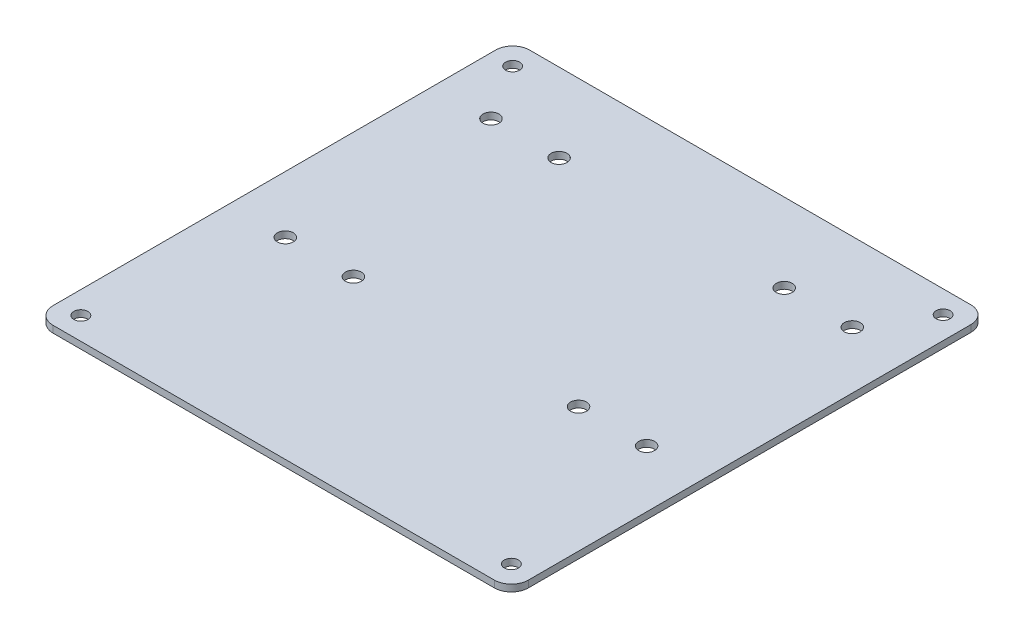
ISO-10303-21;
HEADER;
FILE_DESCRIPTION(('STEP AP214'),'2;1');
FILE_NAME('part.step','',(''),(''),'','','');
FILE_SCHEMA(('AUTOMOTIVE_DESIGN { 1 0 10303 214 1 1 1 1 }'));
ENDSEC;
DATA;
#1=APPLICATION_CONTEXT('core data for automotive mechanical design processes');
#2=APPLICATION_PROTOCOL_DEFINITION('international standard','automotive_design',2000,#1);
#3=PRODUCT_CONTEXT('',#1,'mechanical');
#4=PRODUCT('Part','Part','',(#3));
#5=PRODUCT_RELATED_PRODUCT_CATEGORY('part','',(#4));
#6=PRODUCT_DEFINITION_FORMATION('','',#4);
#7=PRODUCT_DEFINITION_CONTEXT('part definition',#1,'design');
#8=PRODUCT_DEFINITION('design','',#6,#7);
#9=PRODUCT_DEFINITION_SHAPE('','',#8);
#10=(LENGTH_UNIT() NAMED_UNIT(*) SI_UNIT(.MILLI.,.METRE.));
#11=(NAMED_UNIT(*) PLANE_ANGLE_UNIT() SI_UNIT($,.RADIAN.));
#12=(NAMED_UNIT(*) SI_UNIT($,.STERADIAN.) SOLID_ANGLE_UNIT());
#13=UNCERTAINTY_MEASURE_WITH_UNIT(LENGTH_MEASURE(1.E-05),#10,'distance_accuracy_value','');
#14=(GEOMETRIC_REPRESENTATION_CONTEXT(3) GLOBAL_UNCERTAINTY_ASSIGNED_CONTEXT((#13)) GLOBAL_UNIT_ASSIGNED_CONTEXT((#10,
#11,#12)) REPRESENTATION_CONTEXT('',''));
#15=CARTESIAN_POINT('',(0.,0.,0.));
#16=DIRECTION('',(0.,0.,1.));
#17=DIRECTION('',(1.,0.,0.));
#18=AXIS2_PLACEMENT_3D('',#15,#16,#17);
#19=CARTESIAN_POINT('',(0.,1.6,0.));
#20=DIRECTION('',(0.,1.,0.));
#21=DIRECTION('',(0.,0.,1.));
#22=AXIS2_PLACEMENT_3D('',#19,#20,#21);
#23=PLANE('',#22);
#24=CARTESIAN_POINT('',(-42.45,1.6,-37.51));
#25=DIRECTION('',(0.,1.,0.));
#26=DIRECTION('',(0.,0.,-1.));
#27=AXIS2_PLACEMENT_3D('',#24,#25,#26);
#28=CIRCLE('',#27,1.875);
#29=CARTESIAN_POINT('',(-42.45,1.6,-39.385));
#30=VERTEX_POINT('',#29);
#31=EDGE_CURVE('E235',#30,#30,#28,.T.);
#32=ORIENTED_EDGE('',*,*,#31,.F.);
#33=EDGE_LOOP('',(#32));
#34=FACE_BOUND('',#33,.T.);
#35=CARTESIAN_POINT('',(26.45,1.6,-37.51));
#36=DIRECTION('',(0.,1.,0.));
#37=DIRECTION('',(0.,0.,1.));
#38=AXIS2_PLACEMENT_3D('',#35,#36,#37);
#39=CIRCLE('',#38,1.875);
#40=CARTESIAN_POINT('',(26.45,1.6,-35.635));
#41=VERTEX_POINT('',#40);
#42=EDGE_CURVE('E223',#41,#41,#39,.T.);
#43=ORIENTED_EDGE('',*,*,#42,.F.);
#44=EDGE_LOOP('',(#43));
#45=FACE_BOUND('',#44,.T.);
#46=CARTESIAN_POINT('',(42.45,1.6,10.82));
#47=DIRECTION('',(0.,1.,0.));
#48=DIRECTION('',(0.,0.,1.));
#49=AXIS2_PLACEMENT_3D('',#46,#47,#48);
#50=CIRCLE('',#49,1.875);
#51=CARTESIAN_POINT('',(42.45,1.6,12.695));
#52=VERTEX_POINT('',#51);
#53=EDGE_CURVE('E211',#52,#52,#50,.T.);
#54=ORIENTED_EDGE('',*,*,#53,.F.);
#55=EDGE_LOOP('',(#54));
#56=FACE_BOUND('',#55,.T.);
#57=CARTESIAN_POINT('',(26.45,1.6,10.82));
#58=DIRECTION('',(0.,1.,0.));
#59=DIRECTION('',(0.,0.,1.));
#60=AXIS2_PLACEMENT_3D('',#57,#58,#59);
#61=CIRCLE('',#60,1.875);
#62=CARTESIAN_POINT('',(26.45,1.6,12.695));
#63=VERTEX_POINT('',#62);
#64=EDGE_CURVE('E199',#63,#63,#61,.T.);
#65=ORIENTED_EDGE('',*,*,#64,.F.);
#66=EDGE_LOOP('',(#65));
#67=FACE_BOUND('',#66,.T.);
#68=CARTESIAN_POINT('',(50.575,1.6,-50.725));
#69=DIRECTION('',(0.,1.,0.));
#70=DIRECTION('',(0.,0.,1.));
#71=AXIS2_PLACEMENT_3D('',#68,#69,#70);
#72=CIRCLE('',#71,1.65);
#73=CARTESIAN_POINT('',(50.575,1.6,-49.075));
#74=VERTEX_POINT('',#73);
#75=EDGE_CURVE('E187',#74,#74,#72,.T.);
#76=ORIENTED_EDGE('',*,*,#75,.F.);
#77=EDGE_LOOP('',(#76));
#78=FACE_BOUND('',#77,.T.);
#79=CARTESIAN_POINT('',(-50.575,1.6,-50.725));
#80=DIRECTION('',(0.,1.,0.));
#81=DIRECTION('',(0.,0.,1.));
#82=AXIS2_PLACEMENT_3D('',#79,#80,#81);
#83=CIRCLE('',#82,1.65);
#84=CARTESIAN_POINT('',(-50.575,1.6,-49.075));
#85=VERTEX_POINT('',#84);
#86=EDGE_CURVE('E170',#85,#85,#83,.T.);
#87=ORIENTED_EDGE('',*,*,#86,.F.);
#88=EDGE_LOOP('',(#87));
#89=FACE_BOUND('',#88,.T.);
#90=DIRECTION('',(0.,0.,1.));
#91=VECTOR('',#90,1.);
#92=CARTESIAN_POINT('',(-55.85,1.6,-56.));
#93=LINE('',#92,#91);
#94=CARTESIAN_POINT('',(-55.85,1.6,-52.));
#95=VERTEX_POINT('',#94);
#96=CARTESIAN_POINT('',(-55.85,1.6,52.));
#97=VERTEX_POINT('',#96);
#98=EDGE_CURVE('E177',#95,#97,#93,.T.);
#99=ORIENTED_EDGE('',*,*,#98,.T.);
#100=CARTESIAN_POINT('',(-51.85,1.6,52.));
#101=DIRECTION('',(0.,1.,0.));
#102=DIRECTION('',(0.,0.,1.));
#103=AXIS2_PLACEMENT_3D('',#100,#101,#102);
#104=CIRCLE('',#103,4.);
#105=CARTESIAN_POINT('',(-51.85,1.6,56.));
#106=VERTEX_POINT('',#105);
#107=EDGE_CURVE('E154',#97,#106,#104,.T.);
#108=ORIENTED_EDGE('',*,*,#107,.T.);
#109=DIRECTION('',(1.,0.,0.));
#110=VECTOR('',#109,1.);
#111=CARTESIAN_POINT('',(-55.85,1.6,56.));
#112=LINE('',#111,#110);
#113=CARTESIAN_POINT('',(51.85,1.6,56.));
#114=VERTEX_POINT('',#113);
#115=EDGE_CURVE('E125',#106,#114,#112,.T.);
#116=ORIENTED_EDGE('',*,*,#115,.T.);
#117=CARTESIAN_POINT('',(51.85,1.6,52.));
#118=DIRECTION('',(0.,1.,0.));
#119=DIRECTION('',(0.,0.,1.));
#120=AXIS2_PLACEMENT_3D('',#117,#118,#119);
#121=CIRCLE('',#120,4.);
#122=CARTESIAN_POINT('',(55.85,1.6,52.));
#123=VERTEX_POINT('',#122);
#124=EDGE_CURVE('E149',#114,#123,#121,.T.);
#125=ORIENTED_EDGE('',*,*,#124,.T.);
#126=DIRECTION('',(0.,0.,-1.));
#127=VECTOR('',#126,1.);
#128=CARTESIAN_POINT('',(55.85,1.6,-56.));
#129=LINE('',#128,#127);
#130=CARTESIAN_POINT('',(55.85,1.6,-52.));
#131=VERTEX_POINT('',#130);
#132=EDGE_CURVE('E132',#123,#131,#129,.T.);
#133=ORIENTED_EDGE('',*,*,#132,.T.);
#134=CARTESIAN_POINT('',(51.85,1.6,-52.));
#135=DIRECTION('',(0.,1.,0.));
#136=DIRECTION('',(0.,0.,1.));
#137=AXIS2_PLACEMENT_3D('',#134,#135,#136);
#138=CIRCLE('',#137,4.);
#139=CARTESIAN_POINT('',(51.85,1.6,-56.));
#140=VERTEX_POINT('',#139);
#141=EDGE_CURVE('E61',#131,#140,#138,.T.);
#142=ORIENTED_EDGE('',*,*,#141,.T.);
#143=DIRECTION('',(-1.,0.,0.));
#144=VECTOR('',#143,1.);
#145=CARTESIAN_POINT('',(-55.85,1.6,-56.));
#146=LINE('',#145,#144);
#147=CARTESIAN_POINT('',(-51.85,1.6,-56.));
#148=VERTEX_POINT('',#147);
#149=EDGE_CURVE('E135',#140,#148,#146,.T.);
#150=ORIENTED_EDGE('',*,*,#149,.T.);
#151=CARTESIAN_POINT('',(-51.85,1.6,-52.));
#152=DIRECTION('',(0.,1.,0.));
#153=DIRECTION('',(0.,0.,1.));
#154=AXIS2_PLACEMENT_3D('',#151,#152,#153);
#155=CIRCLE('',#154,4.);
#156=EDGE_CURVE('E152',#148,#95,#155,.T.);
#157=ORIENTED_EDGE('',*,*,#156,.T.);
#158=EDGE_LOOP('',(#99,#108,#116,#125,#133,#142,#150,#157));
#159=FACE_BOUND('',#158,.T.);
#160=CARTESIAN_POINT('',(-50.575,1.6,50.725));
#161=DIRECTION('',(0.,1.,0.));
#162=DIRECTION('',(0.,0.,1.));
#163=AXIS2_PLACEMENT_3D('',#160,#161,#162);
#164=CIRCLE('',#163,1.65);
#165=CARTESIAN_POINT('',(-50.575,1.6,52.375));
#166=VERTEX_POINT('',#165);
#167=EDGE_CURVE('E182',#166,#166,#164,.T.);
#168=ORIENTED_EDGE('',*,*,#167,.F.);
#169=EDGE_LOOP('',(#168));
#170=FACE_BOUND('',#169,.T.);
#171=CARTESIAN_POINT('',(50.575,1.6,50.725));
#172=DIRECTION('',(0.,1.,0.));
#173=DIRECTION('',(0.,0.,1.));
#174=AXIS2_PLACEMENT_3D('',#171,#172,#173);
#175=CIRCLE('',#174,1.65);
#176=CARTESIAN_POINT('',(50.575,1.6,52.375));
#177=VERTEX_POINT('',#176);
#178=EDGE_CURVE('E193',#177,#177,#175,.T.);
#179=ORIENTED_EDGE('',*,*,#178,.F.);
#180=EDGE_LOOP('',(#179));
#181=FACE_BOUND('',#180,.T.);
#182=CARTESIAN_POINT('',(-42.45,1.6,10.82));
#183=DIRECTION('',(0.,1.,0.));
#184=DIRECTION('',(0.,0.,-1.));
#185=AXIS2_PLACEMENT_3D('',#182,#183,#184);
#186=CIRCLE('',#185,1.875);
#187=CARTESIAN_POINT('',(-42.45,1.6,8.945));
#188=VERTEX_POINT('',#187);
#189=EDGE_CURVE('E205',#188,#188,#186,.T.);
#190=ORIENTED_EDGE('',*,*,#189,.F.);
#191=EDGE_LOOP('',(#190));
#192=FACE_BOUND('',#191,.T.);
#193=CARTESIAN_POINT('',(42.45,1.6,-37.51));
#194=DIRECTION('',(0.,1.,0.));
#195=DIRECTION('',(0.,0.,1.));
#196=AXIS2_PLACEMENT_3D('',#193,#194,#195);
#197=CIRCLE('',#196,1.875);
#198=CARTESIAN_POINT('',(42.45,1.6,-35.635));
#199=VERTEX_POINT('',#198);
#200=EDGE_CURVE('E217',#199,#199,#197,.T.);
#201=ORIENTED_EDGE('',*,*,#200,.F.);
#202=EDGE_LOOP('',(#201));
#203=FACE_BOUND('',#202,.T.);
#204=CARTESIAN_POINT('',(-26.45,1.6,10.82));
#205=DIRECTION('',(0.,1.,0.));
#206=DIRECTION('',(0.,0.,-1.));
#207=AXIS2_PLACEMENT_3D('',#204,#205,#206);
#208=CIRCLE('',#207,1.875);
#209=CARTESIAN_POINT('',(-26.45,1.6,8.945));
#210=VERTEX_POINT('',#209);
#211=EDGE_CURVE('E229',#210,#210,#208,.T.);
#212=ORIENTED_EDGE('',*,*,#211,.F.);
#213=EDGE_LOOP('',(#212));
#214=FACE_BOUND('',#213,.T.);
#215=CARTESIAN_POINT('',(-26.45,1.6,-37.51));
#216=DIRECTION('',(0.,1.,0.));
#217=DIRECTION('',(0.,0.,-1.));
#218=AXIS2_PLACEMENT_3D('',#215,#216,#217);
#219=CIRCLE('',#218,1.875);
#220=CARTESIAN_POINT('',(-26.45,1.6,-39.385));
#221=VERTEX_POINT('',#220);
#222=EDGE_CURVE('E241',#221,#221,#219,.T.);
#223=ORIENTED_EDGE('',*,*,#222,.F.);
#224=EDGE_LOOP('',(#223));
#225=FACE_BOUND('',#224,.T.);
#226=ADVANCED_FACE('F39',(#34,#45,#56,#67,#78,#89,#159,#170,#181,#192,#203,#214,#225),#23,.T.);
#227=CARTESIAN_POINT('',(0.,0.,0.));
#228=DIRECTION('',(0.,1.,0.));
#229=DIRECTION('',(0.,0.,1.));
#230=AXIS2_PLACEMENT_3D('',#227,#228,#229);
#231=PLANE('',#230);
#232=DIRECTION('',(1.,0.,0.));
#233=VECTOR('',#232,1.);
#234=CARTESIAN_POINT('',(-55.85,0.,56.));
#235=LINE('',#234,#233);
#236=CARTESIAN_POINT('',(-51.85,0.,56.));
#237=VERTEX_POINT('',#236);
#238=CARTESIAN_POINT('',(51.85,0.,56.));
#239=VERTEX_POINT('',#238);
#240=EDGE_CURVE('E122',#237,#239,#235,.T.);
#241=ORIENTED_EDGE('',*,*,#240,.F.);
#242=CARTESIAN_POINT('',(-51.85,0.,52.));
#243=DIRECTION('',(0.,1.,0.));
#244=DIRECTION('',(0.,0.,1.));
#245=AXIS2_PLACEMENT_3D('',#242,#243,#244);
#246=CIRCLE('',#245,4.);
#247=CARTESIAN_POINT('',(-55.85,0.,52.));
#248=VERTEX_POINT('',#247);
#249=EDGE_CURVE('E105',#237,#248,#246,.F.);
#250=ORIENTED_EDGE('',*,*,#249,.T.);
#251=DIRECTION('',(0.,0.,1.));
#252=VECTOR('',#251,1.);
#253=CARTESIAN_POINT('',(-55.85,0.,-56.));
#254=LINE('',#253,#252);
#255=CARTESIAN_POINT('',(-55.85,0.,-52.));
#256=VERTEX_POINT('',#255);
#257=EDGE_CURVE('E133',#256,#248,#254,.T.);
#258=ORIENTED_EDGE('',*,*,#257,.F.);
#259=CARTESIAN_POINT('',(-51.85,0.,-52.));
#260=DIRECTION('',(0.,1.,0.));
#261=DIRECTION('',(0.,0.,1.));
#262=AXIS2_PLACEMENT_3D('',#259,#260,#261);
#263=CIRCLE('',#262,4.);
#264=CARTESIAN_POINT('',(-51.85,0.,-56.));
#265=VERTEX_POINT('',#264);
#266=EDGE_CURVE('E116',#256,#265,#263,.F.);
#267=ORIENTED_EDGE('',*,*,#266,.T.);
#268=DIRECTION('',(-1.,0.,0.));
#269=VECTOR('',#268,1.);
#270=CARTESIAN_POINT('',(-55.85,0.,-56.));
#271=LINE('',#270,#269);
#272=CARTESIAN_POINT('',(51.85,0.,-56.));
#273=VERTEX_POINT('',#272);
#274=EDGE_CURVE('E137',#273,#265,#271,.T.);
#275=ORIENTED_EDGE('',*,*,#274,.F.);
#276=CARTESIAN_POINT('',(51.85,0.,-52.));
#277=DIRECTION('',(0.,1.,0.));
#278=DIRECTION('',(0.,0.,1.));
#279=AXIS2_PLACEMENT_3D('',#276,#277,#278);
#280=CIRCLE('',#279,4.);
#281=CARTESIAN_POINT('',(55.85,0.,-52.));
#282=VERTEX_POINT('',#281);
#283=EDGE_CURVE('E143',#273,#282,#280,.F.);
#284=ORIENTED_EDGE('',*,*,#283,.T.);
#285=DIRECTION('',(0.,0.,-1.));
#286=VECTOR('',#285,1.);
#287=CARTESIAN_POINT('',(55.85,0.,-56.));
#288=LINE('',#287,#286);
#289=CARTESIAN_POINT('',(55.85,0.,52.));
#290=VERTEX_POINT('',#289);
#291=EDGE_CURVE('E165',#290,#282,#288,.T.);
#292=ORIENTED_EDGE('',*,*,#291,.F.);
#293=CARTESIAN_POINT('',(51.85,0.,52.));
#294=DIRECTION('',(0.,1.,0.));
#295=DIRECTION('',(0.,0.,1.));
#296=AXIS2_PLACEMENT_3D('',#293,#294,#295);
#297=CIRCLE('',#296,4.);
#298=EDGE_CURVE('E126',#290,#239,#297,.F.);
#299=ORIENTED_EDGE('',*,*,#298,.T.);
#300=EDGE_LOOP('',(#241,#250,#258,#267,#275,#284,#292,#299));
#301=FACE_BOUND('',#300,.T.);
#302=CARTESIAN_POINT('',(-50.575,0.,-50.725));
#303=DIRECTION('',(0.,1.,0.));
#304=DIRECTION('',(0.,0.,1.));
#305=AXIS2_PLACEMENT_3D('',#302,#303,#304);
#306=CIRCLE('',#305,1.65);
#307=CARTESIAN_POINT('',(-50.575,0.,-49.075));
#308=VERTEX_POINT('',#307);
#309=EDGE_CURVE('E173',#308,#308,#306,.T.);
#310=ORIENTED_EDGE('',*,*,#309,.T.);
#311=EDGE_LOOP('',(#310));
#312=FACE_BOUND('',#311,.T.);
#313=CARTESIAN_POINT('',(-50.575,0.,50.725));
#314=DIRECTION('',(0.,1.,0.));
#315=DIRECTION('',(0.,0.,1.));
#316=AXIS2_PLACEMENT_3D('',#313,#314,#315);
#317=CIRCLE('',#316,1.65);
#318=CARTESIAN_POINT('',(-50.575,0.,52.375));
#319=VERTEX_POINT('',#318);
#320=EDGE_CURVE('E184',#319,#319,#317,.T.);
#321=ORIENTED_EDGE('',*,*,#320,.T.);
#322=EDGE_LOOP('',(#321));
#323=FACE_BOUND('',#322,.T.);
#324=CARTESIAN_POINT('',(50.575,0.,-50.725));
#325=DIRECTION('',(0.,1.,0.));
#326=DIRECTION('',(0.,0.,1.));
#327=AXIS2_PLACEMENT_3D('',#324,#325,#326);
#328=CIRCLE('',#327,1.65);
#329=CARTESIAN_POINT('',(50.575,0.,-49.075));
#330=VERTEX_POINT('',#329);
#331=EDGE_CURVE('E190',#330,#330,#328,.T.);
#332=ORIENTED_EDGE('',*,*,#331,.T.);
#333=EDGE_LOOP('',(#332));
#334=FACE_BOUND('',#333,.T.);
#335=CARTESIAN_POINT('',(50.575,0.,50.725));
#336=DIRECTION('',(0.,1.,0.));
#337=DIRECTION('',(0.,0.,1.));
#338=AXIS2_PLACEMENT_3D('',#335,#336,#337);
#339=CIRCLE('',#338,1.65);
#340=CARTESIAN_POINT('',(50.575,0.,52.375));
#341=VERTEX_POINT('',#340);
#342=EDGE_CURVE('E196',#341,#341,#339,.T.);
#343=ORIENTED_EDGE('',*,*,#342,.T.);
#344=EDGE_LOOP('',(#343));
#345=FACE_BOUND('',#344,.T.);
#346=CARTESIAN_POINT('',(26.45,0.,10.82));
#347=DIRECTION('',(0.,1.,0.));
#348=DIRECTION('',(0.,0.,1.));
#349=AXIS2_PLACEMENT_3D('',#346,#347,#348);
#350=CIRCLE('',#349,1.875);
#351=CARTESIAN_POINT('',(26.45,0.,12.695));
#352=VERTEX_POINT('',#351);
#353=EDGE_CURVE('E202',#352,#352,#350,.T.);
#354=ORIENTED_EDGE('',*,*,#353,.T.);
#355=EDGE_LOOP('',(#354));
#356=FACE_BOUND('',#355,.T.);
#357=CARTESIAN_POINT('',(-42.45,0.,10.82));
#358=DIRECTION('',(0.,1.,0.));
#359=DIRECTION('',(0.,0.,-1.));
#360=AXIS2_PLACEMENT_3D('',#357,#358,#359);
#361=CIRCLE('',#360,1.875);
#362=CARTESIAN_POINT('',(-42.45,0.,8.945));
#363=VERTEX_POINT('',#362);
#364=EDGE_CURVE('E208',#363,#363,#361,.T.);
#365=ORIENTED_EDGE('',*,*,#364,.T.);
#366=EDGE_LOOP('',(#365));
#367=FACE_BOUND('',#366,.T.);
#368=CARTESIAN_POINT('',(42.45,0.,10.82));
#369=DIRECTION('',(0.,1.,0.));
#370=DIRECTION('',(0.,0.,1.));
#371=AXIS2_PLACEMENT_3D('',#368,#369,#370);
#372=CIRCLE('',#371,1.875);
#373=CARTESIAN_POINT('',(42.45,0.,12.695));
#374=VERTEX_POINT('',#373);
#375=EDGE_CURVE('E214',#374,#374,#372,.T.);
#376=ORIENTED_EDGE('',*,*,#375,.T.);
#377=EDGE_LOOP('',(#376));
#378=FACE_BOUND('',#377,.T.);
#379=CARTESIAN_POINT('',(42.45,0.,-37.51));
#380=DIRECTION('',(0.,1.,0.));
#381=DIRECTION('',(0.,0.,1.));
#382=AXIS2_PLACEMENT_3D('',#379,#380,#381);
#383=CIRCLE('',#382,1.875);
#384=CARTESIAN_POINT('',(42.45,0.,-35.635));
#385=VERTEX_POINT('',#384);
#386=EDGE_CURVE('E220',#385,#385,#383,.T.);
#387=ORIENTED_EDGE('',*,*,#386,.T.);
#388=EDGE_LOOP('',(#387));
#389=FACE_BOUND('',#388,.T.);
#390=CARTESIAN_POINT('',(26.45,0.,-37.51));
#391=DIRECTION('',(0.,1.,0.));
#392=DIRECTION('',(0.,0.,1.));
#393=AXIS2_PLACEMENT_3D('',#390,#391,#392);
#394=CIRCLE('',#393,1.875);
#395=CARTESIAN_POINT('',(26.45,0.,-35.635));
#396=VERTEX_POINT('',#395);
#397=EDGE_CURVE('E226',#396,#396,#394,.T.);
#398=ORIENTED_EDGE('',*,*,#397,.T.);
#399=EDGE_LOOP('',(#398));
#400=FACE_BOUND('',#399,.T.);
#401=CARTESIAN_POINT('',(-26.45,0.,10.82));
#402=DIRECTION('',(0.,1.,0.));
#403=DIRECTION('',(0.,0.,-1.));
#404=AXIS2_PLACEMENT_3D('',#401,#402,#403);
#405=CIRCLE('',#404,1.875);
#406=CARTESIAN_POINT('',(-26.45,0.,8.945));
#407=VERTEX_POINT('',#406);
#408=EDGE_CURVE('E232',#407,#407,#405,.T.);
#409=ORIENTED_EDGE('',*,*,#408,.T.);
#410=EDGE_LOOP('',(#409));
#411=FACE_BOUND('',#410,.T.);
#412=CARTESIAN_POINT('',(-42.45,0.,-37.51));
#413=DIRECTION('',(0.,1.,0.));
#414=DIRECTION('',(0.,0.,-1.));
#415=AXIS2_PLACEMENT_3D('',#412,#413,#414);
#416=CIRCLE('',#415,1.875);
#417=CARTESIAN_POINT('',(-42.45,0.,-39.385));
#418=VERTEX_POINT('',#417);
#419=EDGE_CURVE('E238',#418,#418,#416,.T.);
#420=ORIENTED_EDGE('',*,*,#419,.T.);
#421=EDGE_LOOP('',(#420));
#422=FACE_BOUND('',#421,.T.);
#423=CARTESIAN_POINT('',(-26.45,0.,-37.51));
#424=DIRECTION('',(0.,1.,0.));
#425=DIRECTION('',(0.,0.,-1.));
#426=AXIS2_PLACEMENT_3D('',#423,#424,#425);
#427=CIRCLE('',#426,1.875);
#428=CARTESIAN_POINT('',(-26.45,0.,-39.385));
#429=VERTEX_POINT('',#428);
#430=EDGE_CURVE('E244',#429,#429,#427,.T.);
#431=ORIENTED_EDGE('',*,*,#430,.T.);
#432=EDGE_LOOP('',(#431));
#433=FACE_BOUND('',#432,.T.);
#434=ADVANCED_FACE('F129',(#301,#312,#323,#334,#345,#356,#367,#378,#389,#400,#411,#422,#433),
#231,.F.);
#435=CARTESIAN_POINT('',(55.85,1.6,-56.));
#436=DIRECTION('',(-1.,0.,0.));
#437=DIRECTION('',(0.,0.,1.));
#438=AXIS2_PLACEMENT_3D('',#435,#436,#437);
#439=PLANE('',#438);
#440=ORIENTED_EDGE('',*,*,#291,.T.);
#441=DIRECTION('',(0.,-1.,0.));
#442=VECTOR('',#441,1.);
#443=CARTESIAN_POINT('',(55.85,1.6,-52.));
#444=LINE('',#443,#442);
#445=EDGE_CURVE('E11',#282,#131,#444,.F.);
#446=ORIENTED_EDGE('',*,*,#445,.T.);
#447=ORIENTED_EDGE('',*,*,#132,.F.);
#448=DIRECTION('',(0.,-1.,0.));
#449=VECTOR('',#448,1.);
#450=CARTESIAN_POINT('',(55.85,1.6,52.));
#451=LINE('',#450,#449);
#452=EDGE_CURVE('E47',#123,#290,#451,.T.);
#453=ORIENTED_EDGE('',*,*,#452,.T.);
#454=EDGE_LOOP('',(#440,#446,#447,#453));
#455=FACE_BOUND('',#454,.T.);
#456=ADVANCED_FACE('F164',(#455),#439,.F.);
#457=CARTESIAN_POINT('',(-55.85,1.6,-56.));
#458=DIRECTION('',(0.,0.,1.));
#459=DIRECTION('',(1.,0.,0.));
#460=AXIS2_PLACEMENT_3D('',#457,#458,#459);
#461=PLANE('',#460);
#462=ORIENTED_EDGE('',*,*,#274,.T.);
#463=DIRECTION('',(0.,-1.,0.));
#464=VECTOR('',#463,1.);
#465=CARTESIAN_POINT('',(-51.85,1.6,-56.));
#466=LINE('',#465,#464);
#467=EDGE_CURVE('E54',#265,#148,#466,.F.);
#468=ORIENTED_EDGE('',*,*,#467,.T.);
#469=ORIENTED_EDGE('',*,*,#149,.F.);
#470=DIRECTION('',(0.,-1.,0.));
#471=VECTOR('',#470,1.);
#472=CARTESIAN_POINT('',(51.85,1.6,-56.));
#473=LINE('',#472,#471);
#474=EDGE_CURVE('E156',#140,#273,#473,.T.);
#475=ORIENTED_EDGE('',*,*,#474,.T.);
#476=EDGE_LOOP('',(#462,#468,#469,#475));
#477=FACE_BOUND('',#476,.T.);
#478=ADVANCED_FACE('F272',(#477),#461,.F.);
#479=CARTESIAN_POINT('',(-55.85,1.6,-56.));
#480=DIRECTION('',(1.,0.,0.));
#481=DIRECTION('',(0.,0.,-1.));
#482=AXIS2_PLACEMENT_3D('',#479,#480,#481);
#483=PLANE('',#482);
#484=ORIENTED_EDGE('',*,*,#257,.T.);
#485=DIRECTION('',(0.,-1.,0.));
#486=VECTOR('',#485,1.);
#487=CARTESIAN_POINT('',(-55.85,1.6,52.));
#488=LINE('',#487,#486);
#489=EDGE_CURVE('E110',#248,#97,#488,.F.);
#490=ORIENTED_EDGE('',*,*,#489,.T.);
#491=ORIENTED_EDGE('',*,*,#98,.F.);
#492=DIRECTION('',(0.,-1.,0.));
#493=VECTOR('',#492,1.);
#494=CARTESIAN_POINT('',(-55.85,1.6,-52.));
#495=LINE('',#494,#493);
#496=EDGE_CURVE('E115',#95,#256,#495,.T.);
#497=ORIENTED_EDGE('',*,*,#496,.T.);
#498=EDGE_LOOP('',(#484,#490,#491,#497));
#499=FACE_BOUND('',#498,.T.);
#500=ADVANCED_FACE('F269',(#499),#483,.F.);
#501=CARTESIAN_POINT('',(-55.85,1.6,56.));
#502=DIRECTION('',(0.,0.,-1.));
#503=DIRECTION('',(-1.,0.,0.));
#504=AXIS2_PLACEMENT_3D('',#501,#502,#503);
#505=PLANE('',#504);
#506=ORIENTED_EDGE('',*,*,#115,.F.);
#507=DIRECTION('',(0.,-1.,0.));
#508=VECTOR('',#507,1.);
#509=CARTESIAN_POINT('',(-51.85,1.6,56.));
#510=LINE('',#509,#508);
#511=EDGE_CURVE('E109',#106,#237,#510,.T.);
#512=ORIENTED_EDGE('',*,*,#511,.T.);
#513=ORIENTED_EDGE('',*,*,#240,.T.);
#514=DIRECTION('',(0.,-1.,0.));
#515=VECTOR('',#514,1.);
#516=CARTESIAN_POINT('',(51.85,1.6,56.));
#517=LINE('',#516,#515);
#518=EDGE_CURVE('E127',#239,#114,#517,.F.);
#519=ORIENTED_EDGE('',*,*,#518,.T.);
#520=EDGE_LOOP('',(#506,#512,#513,#519));
#521=FACE_BOUND('',#520,.T.);
#522=ADVANCED_FACE('F121',(#521),#505,.F.);
#523=CARTESIAN_POINT('',(-50.575,1.6,-50.725));
#524=DIRECTION('',(0.,-1.,0.));
#525=DIRECTION('',(0.,0.,-1.));
#526=AXIS2_PLACEMENT_3D('',#523,#524,#525);
#527=CYLINDRICAL_SURFACE('',#526,1.65);
#528=ORIENTED_EDGE('',*,*,#86,.T.);
#529=EDGE_LOOP('',(#528));
#530=FACE_BOUND('',#529,.T.);
#531=ORIENTED_EDGE('',*,*,#309,.F.);
#532=EDGE_LOOP('',(#531));
#533=FACE_BOUND('',#532,.T.);
#534=ADVANCED_FACE('F264',(#530,#533),#527,.F.);
#535=CARTESIAN_POINT('',(-50.575,1.6,50.725));
#536=DIRECTION('',(0.,-1.,0.));
#537=DIRECTION('',(0.,0.,-1.));
#538=AXIS2_PLACEMENT_3D('',#535,#536,#537);
#539=CYLINDRICAL_SURFACE('',#538,1.65);
#540=ORIENTED_EDGE('',*,*,#167,.T.);
#541=EDGE_LOOP('',(#540));
#542=FACE_BOUND('',#541,.T.);
#543=ORIENTED_EDGE('',*,*,#320,.F.);
#544=EDGE_LOOP('',(#543));
#545=FACE_BOUND('',#544,.T.);
#546=ADVANCED_FACE('F348',(#542,#545),#539,.F.);
#547=CARTESIAN_POINT('',(50.575,1.6,-50.725));
#548=DIRECTION('',(0.,-1.,0.));
#549=DIRECTION('',(0.,0.,-1.));
#550=AXIS2_PLACEMENT_3D('',#547,#548,#549);
#551=CYLINDRICAL_SURFACE('',#550,1.65);
#552=ORIENTED_EDGE('',*,*,#75,.T.);
#553=EDGE_LOOP('',(#552));
#554=FACE_BOUND('',#553,.T.);
#555=ORIENTED_EDGE('',*,*,#331,.F.);
#556=EDGE_LOOP('',(#555));
#557=FACE_BOUND('',#556,.T.);
#558=ADVANCED_FACE('F345',(#554,#557),#551,.F.);
#559=CARTESIAN_POINT('',(50.575,1.6,50.725));
#560=DIRECTION('',(0.,-1.,0.));
#561=DIRECTION('',(0.,0.,-1.));
#562=AXIS2_PLACEMENT_3D('',#559,#560,#561);
#563=CYLINDRICAL_SURFACE('',#562,1.65);
#564=ORIENTED_EDGE('',*,*,#178,.T.);
#565=EDGE_LOOP('',(#564));
#566=FACE_BOUND('',#565,.T.);
#567=ORIENTED_EDGE('',*,*,#342,.F.);
#568=EDGE_LOOP('',(#567));
#569=FACE_BOUND('',#568,.T.);
#570=ADVANCED_FACE('F341',(#566,#569),#563,.F.);
#571=CARTESIAN_POINT('',(26.45,1.6,10.82));
#572=DIRECTION('',(0.,-1.,0.));
#573=DIRECTION('',(0.,0.,-1.));
#574=AXIS2_PLACEMENT_3D('',#571,#572,#573);
#575=CYLINDRICAL_SURFACE('',#574,1.875);
#576=ORIENTED_EDGE('',*,*,#64,.T.);
#577=EDGE_LOOP('',(#576));
#578=FACE_BOUND('',#577,.T.);
#579=ORIENTED_EDGE('',*,*,#353,.F.);
#580=EDGE_LOOP('',(#579));
#581=FACE_BOUND('',#580,.T.);
#582=ADVANCED_FACE('F337',(#578,#581),#575,.F.);
#583=CARTESIAN_POINT('',(-42.45,1.6,10.82));
#584=DIRECTION('',(0.,-1.,0.));
#585=DIRECTION('',(0.,0.,-1.));
#586=AXIS2_PLACEMENT_3D('',#583,#584,#585);
#587=CYLINDRICAL_SURFACE('',#586,1.875);
#588=ORIENTED_EDGE('',*,*,#189,.T.);
#589=EDGE_LOOP('',(#588));
#590=FACE_BOUND('',#589,.T.);
#591=ORIENTED_EDGE('',*,*,#364,.F.);
#592=EDGE_LOOP('',(#591));
#593=FACE_BOUND('',#592,.T.);
#594=ADVANCED_FACE('F333',(#590,#593),#587,.F.);
#595=CARTESIAN_POINT('',(42.45,1.6,10.82));
#596=DIRECTION('',(0.,-1.,0.));
#597=DIRECTION('',(0.,0.,-1.));
#598=AXIS2_PLACEMENT_3D('',#595,#596,#597);
#599=CYLINDRICAL_SURFACE('',#598,1.875);
#600=ORIENTED_EDGE('',*,*,#53,.T.);
#601=EDGE_LOOP('',(#600));
#602=FACE_BOUND('',#601,.T.);
#603=ORIENTED_EDGE('',*,*,#375,.F.);
#604=EDGE_LOOP('',(#603));
#605=FACE_BOUND('',#604,.T.);
#606=ADVANCED_FACE('F329',(#602,#605),#599,.F.);
#607=CARTESIAN_POINT('',(42.45,1.6,-37.51));
#608=DIRECTION('',(0.,-1.,0.));
#609=DIRECTION('',(0.,0.,-1.));
#610=AXIS2_PLACEMENT_3D('',#607,#608,#609);
#611=CYLINDRICAL_SURFACE('',#610,1.875);
#612=ORIENTED_EDGE('',*,*,#200,.T.);
#613=EDGE_LOOP('',(#612));
#614=FACE_BOUND('',#613,.T.);
#615=ORIENTED_EDGE('',*,*,#386,.F.);
#616=EDGE_LOOP('',(#615));
#617=FACE_BOUND('',#616,.T.);
#618=ADVANCED_FACE('F325',(#614,#617),#611,.F.);
#619=CARTESIAN_POINT('',(26.45,1.6,-37.51));
#620=DIRECTION('',(0.,-1.,0.));
#621=DIRECTION('',(0.,0.,-1.));
#622=AXIS2_PLACEMENT_3D('',#619,#620,#621);
#623=CYLINDRICAL_SURFACE('',#622,1.875);
#624=ORIENTED_EDGE('',*,*,#42,.T.);
#625=EDGE_LOOP('',(#624));
#626=FACE_BOUND('',#625,.T.);
#627=ORIENTED_EDGE('',*,*,#397,.F.);
#628=EDGE_LOOP('',(#627));
#629=FACE_BOUND('',#628,.T.);
#630=ADVANCED_FACE('F308',(#626,#629),#623,.F.);
#631=CARTESIAN_POINT('',(-26.45,1.6,10.82));
#632=DIRECTION('',(0.,-1.,0.));
#633=DIRECTION('',(0.,0.,-1.));
#634=AXIS2_PLACEMENT_3D('',#631,#632,#633);
#635=CYLINDRICAL_SURFACE('',#634,1.875);
#636=ORIENTED_EDGE('',*,*,#211,.T.);
#637=EDGE_LOOP('',(#636));
#638=FACE_BOUND('',#637,.T.);
#639=ORIENTED_EDGE('',*,*,#408,.F.);
#640=EDGE_LOOP('',(#639));
#641=FACE_BOUND('',#640,.T.);
#642=ADVANCED_FACE('F304',(#638,#641),#635,.F.);
#643=CARTESIAN_POINT('',(-42.45,1.6,-37.51));
#644=DIRECTION('',(0.,-1.,0.));
#645=DIRECTION('',(0.,0.,-1.));
#646=AXIS2_PLACEMENT_3D('',#643,#644,#645);
#647=CYLINDRICAL_SURFACE('',#646,1.875);
#648=ORIENTED_EDGE('',*,*,#31,.T.);
#649=EDGE_LOOP('',(#648));
#650=FACE_BOUND('',#649,.T.);
#651=ORIENTED_EDGE('',*,*,#419,.F.);
#652=EDGE_LOOP('',(#651));
#653=FACE_BOUND('',#652,.T.);
#654=ADVANCED_FACE('F307',(#650,#653),#647,.F.);
#655=CARTESIAN_POINT('',(-26.45,1.6,-37.51));
#656=DIRECTION('',(0.,-1.,0.));
#657=DIRECTION('',(0.,0.,-1.));
#658=AXIS2_PLACEMENT_3D('',#655,#656,#657);
#659=CYLINDRICAL_SURFACE('',#658,1.875);
#660=ORIENTED_EDGE('',*,*,#222,.T.);
#661=EDGE_LOOP('',(#660));
#662=FACE_BOUND('',#661,.T.);
#663=ORIENTED_EDGE('',*,*,#430,.F.);
#664=EDGE_LOOP('',(#663));
#665=FACE_BOUND('',#664,.T.);
#666=ADVANCED_FACE('F250',(#662,#665),#659,.F.);
#667=CARTESIAN_POINT('',(-51.85,1.6,52.));
#668=DIRECTION('',(0.,-1.,0.));
#669=DIRECTION('',(0.,0.,-1.));
#670=AXIS2_PLACEMENT_3D('',#667,#668,#669);
#671=CYLINDRICAL_SURFACE('',#670,4.);
#672=ORIENTED_EDGE('',*,*,#107,.F.);
#673=ORIENTED_EDGE('',*,*,#489,.F.);
#674=ORIENTED_EDGE('',*,*,#249,.F.);
#675=ORIENTED_EDGE('',*,*,#511,.F.);
#676=EDGE_LOOP('',(#672,#673,#674,#675));
#677=FACE_BOUND('',#676,.T.);
#678=ADVANCED_FACE('F108',(#677),#671,.T.);
#679=CARTESIAN_POINT('',(-51.85,1.6,-52.));
#680=DIRECTION('',(0.,-1.,0.));
#681=DIRECTION('',(0.,0.,-1.));
#682=AXIS2_PLACEMENT_3D('',#679,#680,#681);
#683=CYLINDRICAL_SURFACE('',#682,4.);
#684=ORIENTED_EDGE('',*,*,#156,.F.);
#685=ORIENTED_EDGE('',*,*,#467,.F.);
#686=ORIENTED_EDGE('',*,*,#266,.F.);
#687=ORIENTED_EDGE('',*,*,#496,.F.);
#688=EDGE_LOOP('',(#684,#685,#686,#687));
#689=FACE_BOUND('',#688,.T.);
#690=ADVANCED_FACE('F280',(#689),#683,.T.);
#691=CARTESIAN_POINT('',(51.85,1.6,-52.));
#692=DIRECTION('',(0.,-1.,0.));
#693=DIRECTION('',(0.,0.,-1.));
#694=AXIS2_PLACEMENT_3D('',#691,#692,#693);
#695=CYLINDRICAL_SURFACE('',#694,4.);
#696=ORIENTED_EDGE('',*,*,#141,.F.);
#697=ORIENTED_EDGE('',*,*,#445,.F.);
#698=ORIENTED_EDGE('',*,*,#283,.F.);
#699=ORIENTED_EDGE('',*,*,#474,.F.);
#700=EDGE_LOOP('',(#696,#697,#698,#699));
#701=FACE_BOUND('',#700,.T.);
#702=ADVANCED_FACE('F282',(#701),#695,.T.);
#703=CARTESIAN_POINT('',(51.85,1.6,52.));
#704=DIRECTION('',(0.,-1.,0.));
#705=DIRECTION('',(0.,0.,-1.));
#706=AXIS2_PLACEMENT_3D('',#703,#704,#705);
#707=CYLINDRICAL_SURFACE('',#706,4.);
#708=ORIENTED_EDGE('',*,*,#124,.F.);
#709=ORIENTED_EDGE('',*,*,#518,.F.);
#710=ORIENTED_EDGE('',*,*,#298,.F.);
#711=ORIENTED_EDGE('',*,*,#452,.F.);
#712=EDGE_LOOP('',(#708,#709,#710,#711));
#713=FACE_BOUND('',#712,.T.);
#714=ADVANCED_FACE('F41',(#713),#707,.T.);
#715=CLOSED_SHELL('',(#226,#434,#456,#478,#500,#522,#534,#546,#558,#570,#582,#594,#606,#618,
#630,#642,#654,#666,#678,#690,#702,#714));
#716=MANIFOLD_SOLID_BREP('B2',#715);
#717=ADVANCED_BREP_SHAPE_REPRESENTATION('',(#18,#716),#14);
#718=SHAPE_DEFINITION_REPRESENTATION(#9,#717);
ENDSEC;
END-ISO-10303-21;
